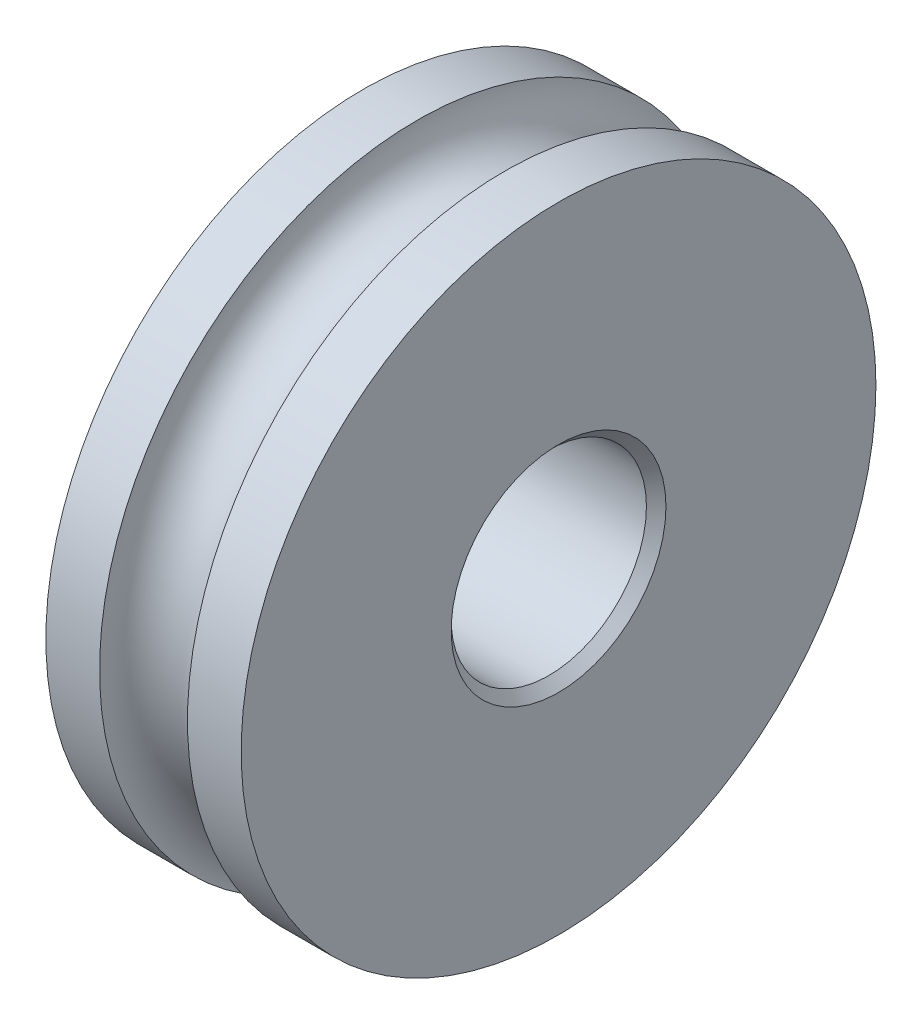
ISO-10303-21;
HEADER;
FILE_DESCRIPTION(('STEP AP214'),'2;1');
FILE_NAME('part.step','',(''),(''),'','','');
FILE_SCHEMA(('AUTOMOTIVE_DESIGN { 1 0 10303 214 1 1 1 1 }'));
ENDSEC;
DATA;
#1=APPLICATION_CONTEXT('core data for automotive mechanical design processes');
#2=APPLICATION_PROTOCOL_DEFINITION('international standard','automotive_design',2000,#1);
#3=PRODUCT_CONTEXT('',#1,'mechanical');
#4=PRODUCT('Part','Part','',(#3));
#5=PRODUCT_RELATED_PRODUCT_CATEGORY('part','',(#4));
#6=PRODUCT_DEFINITION_FORMATION('','',#4);
#7=PRODUCT_DEFINITION_CONTEXT('part definition',#1,'design');
#8=PRODUCT_DEFINITION('design','',#6,#7);
#9=PRODUCT_DEFINITION_SHAPE('','',#8);
#10=(LENGTH_UNIT() NAMED_UNIT(*) SI_UNIT(.MILLI.,.METRE.));
#11=(NAMED_UNIT(*) PLANE_ANGLE_UNIT() SI_UNIT($,.RADIAN.));
#12=(NAMED_UNIT(*) SI_UNIT($,.STERADIAN.) SOLID_ANGLE_UNIT());
#13=UNCERTAINTY_MEASURE_WITH_UNIT(LENGTH_MEASURE(1.E-05),#10,'distance_accuracy_value','');
#14=(GEOMETRIC_REPRESENTATION_CONTEXT(3) GLOBAL_UNCERTAINTY_ASSIGNED_CONTEXT((#13)) GLOBAL_UNIT_ASSIGNED_CONTEXT((#10,
#11,#12)) REPRESENTATION_CONTEXT('',''));
#15=CARTESIAN_POINT('',(0.,0.,0.));
#16=DIRECTION('',(0.,0.,1.));
#17=DIRECTION('',(1.,0.,0.));
#18=AXIS2_PLACEMENT_3D('',#15,#16,#17);
#19=CARTESIAN_POINT('',(0.,2.,0.));
#20=DIRECTION('',(-1.,0.,0.));
#21=DIRECTION('',(0.,0.,1.));
#22=AXIS2_PLACEMENT_3D('',#19,#20,#21);
#23=PLANE('',#22);
#24=CARTESIAN_POINT('',(0.,0.,0.));
#25=DIRECTION('',(-1.,0.,0.));
#26=DIRECTION('',(0.,0.,1.));
#27=AXIS2_PLACEMENT_3D('',#24,#25,#26);
#28=CIRCLE('',#27,2.2);
#29=CARTESIAN_POINT('',(0.,0.,2.2));
#30=VERTEX_POINT('',#29);
#31=EDGE_CURVE('E47',#30,#30,#28,.F.);
#32=ORIENTED_EDGE('',*,*,#31,.T.);
#33=EDGE_LOOP('',(#32));
#34=FACE_BOUND('',#33,.T.);
#35=CARTESIAN_POINT('',(0.,0.,0.));
#36=DIRECTION('',(1.,0.,0.));
#37=DIRECTION('',(0.,0.,-1.));
#38=AXIS2_PLACEMENT_3D('',#35,#36,#37);
#39=CIRCLE('',#38,6.5);
#40=CARTESIAN_POINT('',(0.,0.,-6.5));
#41=VERTEX_POINT('',#40);
#42=EDGE_CURVE('E61',#41,#41,#39,.T.);
#43=ORIENTED_EDGE('',*,*,#42,.F.);
#44=EDGE_LOOP('',(#43));
#45=FACE_BOUND('',#44,.T.);
#46=ADVANCED_FACE('F32',(#34,#45),#23,.T.);
#47=CARTESIAN_POINT('',(7.18815515975983,0.,0.));
#48=DIRECTION('',(1.,0.,0.));
#49=DIRECTION('',(0.,0.,-1.));
#50=AXIS2_PLACEMENT_3D('',#47,#48,#49);
#51=CYLINDRICAL_SURFACE('',#50,2.);
#52=CARTESIAN_POINT('',(0.200000000000001,0.,0.));
#53=DIRECTION('',(-1.,0.,0.));
#54=DIRECTION('',(0.,0.,1.));
#55=AXIS2_PLACEMENT_3D('',#52,#53,#54);
#56=CIRCLE('',#55,2.);
#57=CARTESIAN_POINT('',(0.200000000000001,0.,2.));
#58=VERTEX_POINT('',#57);
#59=EDGE_CURVE('E39',#58,#58,#56,.T.);
#60=ORIENTED_EDGE('',*,*,#59,.T.);
#61=EDGE_LOOP('',(#60));
#62=FACE_BOUND('',#61,.T.);
#63=CARTESIAN_POINT('',(3.80000000000001,0.,0.));
#64=DIRECTION('',(1.,0.,0.));
#65=DIRECTION('',(0.,0.,-1.));
#66=AXIS2_PLACEMENT_3D('',#63,#64,#65);
#67=CIRCLE('',#66,2.);
#68=CARTESIAN_POINT('',(3.80000000000001,0.,-2.));
#69=VERTEX_POINT('',#68);
#70=EDGE_CURVE('E43',#69,#69,#67,.T.);
#71=ORIENTED_EDGE('',*,*,#70,.T.);
#72=EDGE_LOOP('',(#71));
#73=FACE_BOUND('',#72,.T.);
#74=ADVANCED_FACE('F69',(#62,#73),#51,.F.);
#75=CARTESIAN_POINT('',(4.,2.,0.));
#76=DIRECTION('',(1.,0.,0.));
#77=DIRECTION('',(0.,0.,-1.));
#78=AXIS2_PLACEMENT_3D('',#75,#76,#77);
#79=PLANE('',#78);
#80=CARTESIAN_POINT('',(4.,0.,0.));
#81=DIRECTION('',(1.,0.,0.));
#82=DIRECTION('',(0.,0.,-1.));
#83=AXIS2_PLACEMENT_3D('',#80,#81,#82);
#84=CIRCLE('',#83,2.2);
#85=CARTESIAN_POINT('',(4.,0.,-2.2));
#86=VERTEX_POINT('',#85);
#87=EDGE_CURVE('E10',#86,#86,#84,.F.);
#88=ORIENTED_EDGE('',*,*,#87,.T.);
#89=EDGE_LOOP('',(#88));
#90=FACE_BOUND('',#89,.T.);
#91=CARTESIAN_POINT('',(4.,0.,0.));
#92=DIRECTION('',(1.,0.,0.));
#93=DIRECTION('',(0.,0.,-1.));
#94=AXIS2_PLACEMENT_3D('',#91,#92,#93);
#95=CIRCLE('',#94,6.5);
#96=CARTESIAN_POINT('',(4.,0.,-6.5));
#97=VERTEX_POINT('',#96);
#98=EDGE_CURVE('E52',#97,#97,#95,.T.);
#99=ORIENTED_EDGE('',*,*,#98,.T.);
#100=EDGE_LOOP('',(#99));
#101=FACE_BOUND('',#100,.T.);
#102=ADVANCED_FACE('F75',(#90,#101),#79,.T.);
#103=CARTESIAN_POINT('',(7.18815515975983,0.,0.));
#104=DIRECTION('',(1.,0.,0.));
#105=DIRECTION('',(0.,0.,-1.));
#106=AXIS2_PLACEMENT_3D('',#103,#104,#105);
#107=CYLINDRICAL_SURFACE('',#106,6.5);
#108=CARTESIAN_POINT('',(2.9,0.,0.));
#109=DIRECTION('',(1.,0.,0.));
#110=DIRECTION('',(0.,0.,-1.));
#111=AXIS2_PLACEMENT_3D('',#108,#109,#110);
#112=CIRCLE('',#111,6.5);
#113=CARTESIAN_POINT('',(2.9,0.,-6.5));
#114=VERTEX_POINT('',#113);
#115=EDGE_CURVE('E55',#114,#114,#112,.T.);
#116=ORIENTED_EDGE('',*,*,#115,.T.);
#117=EDGE_LOOP('',(#116));
#118=FACE_BOUND('',#117,.T.);
#119=ORIENTED_EDGE('',*,*,#98,.F.);
#120=EDGE_LOOP('',(#119));
#121=FACE_BOUND('',#120,.T.);
#122=ADVANCED_FACE('F93',(#118,#121),#107,.T.);
#123=CARTESIAN_POINT('',(2.,0.,0.));
#124=DIRECTION('',(1.,0.,0.));
#125=DIRECTION('',(0.,0.,-1.));
#126=AXIS2_PLACEMENT_3D('',#123,#124,#125);
#127=TOROIDAL_SURFACE('',#126,6.5,0.9);
#128=CARTESIAN_POINT('',(1.1,0.,0.));
#129=DIRECTION('',(1.,0.,0.));
#130=DIRECTION('',(0.,0.,-1.));
#131=AXIS2_PLACEMENT_3D('',#128,#129,#130);
#132=CIRCLE('',#131,6.5);
#133=CARTESIAN_POINT('',(1.1,0.,-6.5));
#134=VERTEX_POINT('',#133);
#135=EDGE_CURVE('E58',#134,#134,#132,.T.);
#136=ORIENTED_EDGE('',*,*,#135,.T.);
#137=EDGE_LOOP('',(#136));
#138=FACE_BOUND('',#137,.T.);
#139=ORIENTED_EDGE('',*,*,#115,.F.);
#140=EDGE_LOOP('',(#139));
#141=FACE_BOUND('',#140,.T.);
#142=ADVANCED_FACE('F86',(#138,#141),#127,.F.);
#143=CARTESIAN_POINT('',(7.18815515975983,0.,0.));
#144=DIRECTION('',(1.,0.,0.));
#145=DIRECTION('',(0.,0.,-1.));
#146=AXIS2_PLACEMENT_3D('',#143,#144,#145);
#147=CYLINDRICAL_SURFACE('',#146,6.5);
#148=ORIENTED_EDGE('',*,*,#42,.T.);
#149=EDGE_LOOP('',(#148));
#150=FACE_BOUND('',#149,.T.);
#151=ORIENTED_EDGE('',*,*,#135,.F.);
#152=EDGE_LOOP('',(#151));
#153=FACE_BOUND('',#152,.T.);
#154=ADVANCED_FACE('F65',(#150,#153),#147,.T.);
#155=CARTESIAN_POINT('',(0.,0.,0.));
#156=DIRECTION('',(-1.,0.,0.));
#157=DIRECTION('',(0.,0.,1.));
#158=AXIS2_PLACEMENT_3D('',#155,#156,#157);
#159=CONICAL_SURFACE('',#158,2.2,0.785398163397448);
#160=ORIENTED_EDGE('',*,*,#59,.F.);
#161=EDGE_LOOP('',(#160));
#162=FACE_BOUND('',#161,.T.);
#163=ORIENTED_EDGE('',*,*,#31,.F.);
#164=EDGE_LOOP('',(#163));
#165=FACE_BOUND('',#164,.T.);
#166=ADVANCED_FACE('F78',(#162,#165),#159,.F.);
#167=CARTESIAN_POINT('',(3.80000000000001,0.,0.));
#168=DIRECTION('',(1.,0.,0.));
#169=DIRECTION('',(0.,0.,-1.));
#170=AXIS2_PLACEMENT_3D('',#167,#168,#169);
#171=CONICAL_SURFACE('',#170,2.,0.785398163397453);
#172=ORIENTED_EDGE('',*,*,#87,.F.);
#173=EDGE_LOOP('',(#172));
#174=FACE_BOUND('',#173,.T.);
#175=ORIENTED_EDGE('',*,*,#70,.F.);
#176=EDGE_LOOP('',(#175));
#177=FACE_BOUND('',#176,.T.);
#178=ADVANCED_FACE('F34',(#174,#177),#171,.F.);
#179=CLOSED_SHELL('',(#46,#74,#102,#122,#142,#154,#166,#178));
#180=MANIFOLD_SOLID_BREP('B2',#179);
#181=ADVANCED_BREP_SHAPE_REPRESENTATION('',(#18,#180),#14);
#182=SHAPE_DEFINITION_REPRESENTATION(#9,#181);
ENDSEC;
END-ISO-10303-21;
